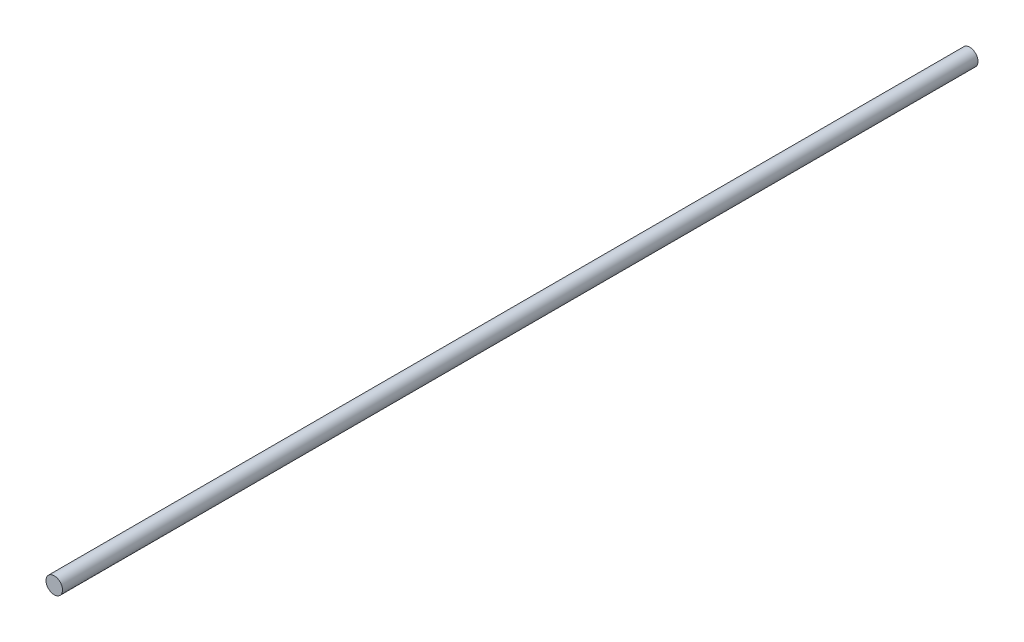
ISO-10303-21;
HEADER;
FILE_DESCRIPTION(('STEP AP214'),'2;1');
FILE_NAME('part.step','',(''),(''),'','','');
FILE_SCHEMA(('AUTOMOTIVE_DESIGN { 1 0 10303 214 1 1 1 1 }'));
ENDSEC;
DATA;
#1=APPLICATION_CONTEXT('core data for automotive mechanical design processes');
#2=APPLICATION_PROTOCOL_DEFINITION('international standard','automotive_design',2000,#1);
#3=PRODUCT_CONTEXT('',#1,'mechanical');
#4=PRODUCT('Part','Part','',(#3));
#5=PRODUCT_RELATED_PRODUCT_CATEGORY('part','',(#4));
#6=PRODUCT_DEFINITION_FORMATION('','',#4);
#7=PRODUCT_DEFINITION_CONTEXT('part definition',#1,'design');
#8=PRODUCT_DEFINITION('design','',#6,#7);
#9=PRODUCT_DEFINITION_SHAPE('','',#8);
#10=(LENGTH_UNIT() NAMED_UNIT(*) SI_UNIT(.MILLI.,.METRE.));
#11=(NAMED_UNIT(*) PLANE_ANGLE_UNIT() SI_UNIT($,.RADIAN.));
#12=(NAMED_UNIT(*) SI_UNIT($,.STERADIAN.) SOLID_ANGLE_UNIT());
#13=UNCERTAINTY_MEASURE_WITH_UNIT(LENGTH_MEASURE(1.E-05),#10,'distance_accuracy_value','');
#14=(GEOMETRIC_REPRESENTATION_CONTEXT(3) GLOBAL_UNCERTAINTY_ASSIGNED_CONTEXT((#13)) GLOBAL_UNIT_ASSIGNED_CONTEXT((#10,
#11,#12)) REPRESENTATION_CONTEXT('',''));
#15=CARTESIAN_POINT('',(0.,0.,0.));
#16=DIRECTION('',(0.,0.,1.));
#17=DIRECTION('',(1.,0.,0.));
#18=AXIS2_PLACEMENT_3D('',#15,#16,#17);
#19=CARTESIAN_POINT('',(-4.87687926133831,119.437033127376,431.792414596241));
#20=DIRECTION('',(0.,0.,-1.));
#21=DIRECTION('',(-1.,0.,0.));
#22=AXIS2_PLACEMENT_3D('',#19,#20,#21);
#23=CYLINDRICAL_SURFACE('',#22,3.7970867);
#24=CARTESIAN_POINT('',(-4.87687926133831,119.437033127376,0.));
#25=DIRECTION('',(0.,0.,1.));
#26=DIRECTION('',(1.,0.,0.));
#27=AXIS2_PLACEMENT_3D('',#24,#25,#26);
#28=CIRCLE('',#27,3.7970867);
#29=CARTESIAN_POINT('',(-1.07979256133831,119.437033127376,0.));
#30=VERTEX_POINT('',#29);
#31=EDGE_CURVE('E37',#30,#30,#28,.T.);
#32=ORIENTED_EDGE('',*,*,#31,.T.);
#33=EDGE_LOOP('',(#32));
#34=FACE_BOUND('',#33,.T.);
#35=CARTESIAN_POINT('',(-4.87687926133831,119.437033127376,421.052631578947));
#36=DIRECTION('',(0.,0.,1.));
#37=DIRECTION('',(1.,0.,0.));
#38=AXIS2_PLACEMENT_3D('',#35,#36,#37);
#39=CIRCLE('',#38,3.7970867);
#40=CARTESIAN_POINT('',(-1.07979256133831,119.437033127376,421.052631578947));
#41=VERTEX_POINT('',#40);
#42=EDGE_CURVE('E10',#41,#41,#39,.T.);
#43=ORIENTED_EDGE('',*,*,#42,.F.);
#44=EDGE_LOOP('',(#43));
#45=FACE_BOUND('',#44,.T.);
#46=ADVANCED_FACE('F31',(#34,#45),#23,.T.);
#47=CARTESIAN_POINT('',(-4.87687926133831,119.437033127376,0.));
#48=DIRECTION('',(0.,0.,1.));
#49=DIRECTION('',(1.,0.,0.));
#50=AXIS2_PLACEMENT_3D('',#47,#48,#49);
#51=PLANE('',#50);
#52=ORIENTED_EDGE('',*,*,#31,.F.);
#53=EDGE_LOOP('',(#52));
#54=FACE_BOUND('',#53,.T.);
#55=ADVANCED_FACE('F45',(#54),#51,.F.);
#56=CARTESIAN_POINT('',(100.,500.,421.052631578947));
#57=DIRECTION('',(0.,0.,1.));
#58=DIRECTION('',(0.,-1.,0.));
#59=AXIS2_PLACEMENT_3D('',#56,#57,#58);
#60=PLANE('',#59);
#61=ORIENTED_EDGE('',*,*,#42,.T.);
#62=EDGE_LOOP('',(#61));
#63=FACE_BOUND('',#62,.T.);
#64=ADVANCED_FACE('F47',(#63),#60,.T.);
#65=CLOSED_SHELL('',(#46,#55,#64));
#66=MANIFOLD_SOLID_BREP('B2',#65);
#67=ADVANCED_BREP_SHAPE_REPRESENTATION('',(#18,#66),#14);
#68=SHAPE_DEFINITION_REPRESENTATION(#9,#67);
ENDSEC;
END-ISO-10303-21;
